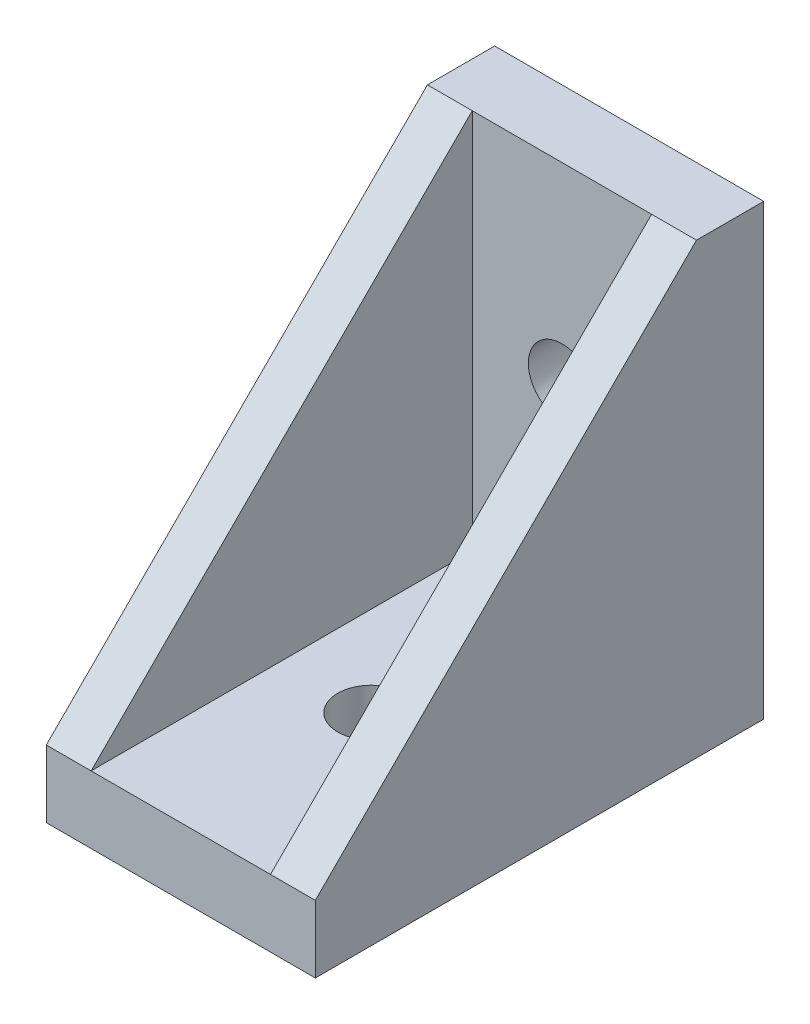
ISO-10303-21;
HEADER;
FILE_DESCRIPTION(('STEP AP214'),'2;1');
FILE_NAME('part.step','',(''),(''),'','','');
FILE_SCHEMA(('AUTOMOTIVE_DESIGN { 1 0 10303 214 1 1 1 1 }'));
ENDSEC;
DATA;
#1=APPLICATION_CONTEXT('core data for automotive mechanical design processes');
#2=APPLICATION_PROTOCOL_DEFINITION('international standard','automotive_design',2000,#1);
#3=PRODUCT_CONTEXT('',#1,'mechanical');
#4=PRODUCT('Part','Part','',(#3));
#5=PRODUCT_RELATED_PRODUCT_CATEGORY('part','',(#4));
#6=PRODUCT_DEFINITION_FORMATION('','',#4);
#7=PRODUCT_DEFINITION_CONTEXT('part definition',#1,'design');
#8=PRODUCT_DEFINITION('design','',#6,#7);
#9=PRODUCT_DEFINITION_SHAPE('','',#8);
#10=(LENGTH_UNIT() NAMED_UNIT(*) SI_UNIT(.MILLI.,.METRE.));
#11=(NAMED_UNIT(*) PLANE_ANGLE_UNIT() SI_UNIT($,.RADIAN.));
#12=(NAMED_UNIT(*) SI_UNIT($,.STERADIAN.) SOLID_ANGLE_UNIT());
#13=UNCERTAINTY_MEASURE_WITH_UNIT(LENGTH_MEASURE(1.E-05),#10,'distance_accuracy_value','');
#14=(GEOMETRIC_REPRESENTATION_CONTEXT(3) GLOBAL_UNCERTAINTY_ASSIGNED_CONTEXT((#13)) GLOBAL_UNIT_ASSIGNED_CONTEXT((#10,
#11,#12)) REPRESENTATION_CONTEXT('',''));
#15=CARTESIAN_POINT('',(0.,0.,0.));
#16=DIRECTION('',(0.,0.,1.));
#17=DIRECTION('',(1.,0.,0.));
#18=AXIS2_PLACEMENT_3D('',#15,#16,#17);
#19=CARTESIAN_POINT('',(6.,3.,0.));
#20=DIRECTION('',(0.,1.,0.));
#21=DIRECTION('',(0.,0.,1.));
#22=AXIS2_PLACEMENT_3D('',#19,#20,#21);
#23=PLANE('',#22);
#24=DIRECTION('',(0.,0.,-1.));
#25=VECTOR('',#24,1.);
#26=CARTESIAN_POINT('',(-4.,3.,0.));
#27=LINE('',#26,#25);
#28=CARTESIAN_POINT('',(-4.,3.,20.));
#29=VERTEX_POINT('',#28);
#30=CARTESIAN_POINT('',(-4.,3.,3.));
#31=VERTEX_POINT('',#30);
#32=EDGE_CURVE('E109',#29,#31,#27,.T.);
#33=ORIENTED_EDGE('',*,*,#32,.F.);
#34=DIRECTION('',(-1.,0.,0.));
#35=VECTOR('',#34,1.);
#36=CARTESIAN_POINT('',(6.,3.,20.));
#37=LINE('',#36,#35);
#38=CARTESIAN_POINT('',(4.,3.,20.));
#39=VERTEX_POINT('',#38);
#40=EDGE_CURVE('E131',#39,#29,#37,.T.);
#41=ORIENTED_EDGE('',*,*,#40,.F.);
#42=DIRECTION('',(0.,0.,-1.));
#43=VECTOR('',#42,1.);
#44=CARTESIAN_POINT('',(4.,3.,0.));
#45=LINE('',#44,#43);
#46=CARTESIAN_POINT('',(4.,3.,3.));
#47=VERTEX_POINT('',#46);
#48=EDGE_CURVE('E56',#39,#47,#45,.T.);
#49=ORIENTED_EDGE('',*,*,#48,.T.);
#50=DIRECTION('',(-1.,0.,0.));
#51=VECTOR('',#50,1.);
#52=CARTESIAN_POINT('',(6.,3.,3.));
#53=LINE('',#52,#51);
#54=EDGE_CURVE('E125',#47,#31,#53,.T.);
#55=ORIENTED_EDGE('',*,*,#54,.T.);
#56=EDGE_LOOP('',(#33,#41,#49,#55));
#57=FACE_BOUND('',#56,.T.);
#58=CARTESIAN_POINT('',(0.,2.99999999999998,11.5));
#59=DIRECTION('',(0.,-1.,0.));
#60=DIRECTION('',(1.,0.,0.));
#61=AXIS2_PLACEMENT_3D('',#58,#59,#60);
#62=CIRCLE('',#61,1.5);
#63=CARTESIAN_POINT('',(1.5,2.99999999999998,11.5));
#64=VERTEX_POINT('',#63);
#65=EDGE_CURVE('E174',#64,#64,#62,.T.);
#66=ORIENTED_EDGE('',*,*,#65,.T.);
#67=EDGE_LOOP('',(#66));
#68=FACE_BOUND('',#67,.T.);
#69=ADVANCED_FACE('F33',(#57,#68),#23,.T.);
#70=CARTESIAN_POINT('',(6.,0.,0.));
#71=DIRECTION('',(0.,-1.,0.));
#72=DIRECTION('',(0.,0.,-1.));
#73=AXIS2_PLACEMENT_3D('',#70,#71,#72);
#74=PLANE('',#73);
#75=DIRECTION('',(0.,0.,1.));
#76=VECTOR('',#75,1.);
#77=CARTESIAN_POINT('',(-6.,0.,0.));
#78=LINE('',#77,#76);
#79=CARTESIAN_POINT('',(-6.,0.,0.));
#80=VERTEX_POINT('',#79);
#81=CARTESIAN_POINT('',(-6.,0.,20.));
#82=VERTEX_POINT('',#81);
#83=EDGE_CURVE('E137',#80,#82,#78,.T.);
#84=ORIENTED_EDGE('',*,*,#83,.F.);
#85=DIRECTION('',(-1.,0.,0.));
#86=VECTOR('',#85,1.);
#87=CARTESIAN_POINT('',(6.,0.,0.));
#88=LINE('',#87,#86);
#89=CARTESIAN_POINT('',(6.,0.,0.));
#90=VERTEX_POINT('',#89);
#91=EDGE_CURVE('E134',#90,#80,#88,.T.);
#92=ORIENTED_EDGE('',*,*,#91,.F.);
#93=DIRECTION('',(0.,0.,1.));
#94=VECTOR('',#93,1.);
#95=CARTESIAN_POINT('',(6.,0.,0.));
#96=LINE('',#95,#94);
#97=CARTESIAN_POINT('',(6.,0.,20.));
#98=VERTEX_POINT('',#97);
#99=EDGE_CURVE('E136',#90,#98,#96,.T.);
#100=ORIENTED_EDGE('',*,*,#99,.T.);
#101=DIRECTION('',(-1.,0.,0.));
#102=VECTOR('',#101,1.);
#103=CARTESIAN_POINT('',(6.,0.,20.));
#104=LINE('',#103,#102);
#105=EDGE_CURVE('E132',#98,#82,#104,.T.);
#106=ORIENTED_EDGE('',*,*,#105,.T.);
#107=EDGE_LOOP('',(#84,#92,#100,#106));
#108=FACE_BOUND('',#107,.T.);
#109=CARTESIAN_POINT('',(0.,0.,11.5));
#110=DIRECTION('',(0.,-1.,0.));
#111=DIRECTION('',(1.,0.,0.));
#112=AXIS2_PLACEMENT_3D('',#109,#110,#111);
#113=CIRCLE('',#112,1.5);
#114=CARTESIAN_POINT('',(1.5,0.,11.5));
#115=VERTEX_POINT('',#114);
#116=EDGE_CURVE('E171',#115,#115,#113,.T.);
#117=ORIENTED_EDGE('',*,*,#116,.F.);
#118=EDGE_LOOP('',(#117));
#119=FACE_BOUND('',#118,.T.);
#120=ADVANCED_FACE('F183',(#108,#119),#74,.T.);
#121=CARTESIAN_POINT('',(6.,0.,3.));
#122=DIRECTION('',(0.,0.,1.));
#123=DIRECTION('',(1.,0.,0.));
#124=AXIS2_PLACEMENT_3D('',#121,#122,#123);
#125=PLANE('',#124);
#126=CARTESIAN_POINT('',(0.,11.5,3.));
#127=DIRECTION('',(0.,0.,1.));
#128=DIRECTION('',(1.,0.,0.));
#129=AXIS2_PLACEMENT_3D('',#126,#127,#128);
#130=CIRCLE('',#129,1.5);
#131=CARTESIAN_POINT('',(1.5,11.5,3.));
#132=VERTEX_POINT('',#131);
#133=EDGE_CURVE('E168',#132,#132,#130,.T.);
#134=ORIENTED_EDGE('',*,*,#133,.F.);
#135=EDGE_LOOP('',(#134));
#136=FACE_BOUND('',#135,.T.);
#137=DIRECTION('',(0.,1.,0.));
#138=VECTOR('',#137,1.);
#139=CARTESIAN_POINT('',(-4.,0.,3.));
#140=LINE('',#139,#138);
#141=CARTESIAN_POINT('',(-4.,20.,3.));
#142=VERTEX_POINT('',#141);
#143=EDGE_CURVE('E110',#31,#142,#140,.T.);
#144=ORIENTED_EDGE('',*,*,#143,.F.);
#145=ORIENTED_EDGE('',*,*,#54,.F.);
#146=DIRECTION('',(0.,1.,0.));
#147=VECTOR('',#146,1.);
#148=CARTESIAN_POINT('',(4.,0.,3.));
#149=LINE('',#148,#147);
#150=CARTESIAN_POINT('',(4.,20.,3.));
#151=VERTEX_POINT('',#150);
#152=EDGE_CURVE('E48',#47,#151,#149,.T.);
#153=ORIENTED_EDGE('',*,*,#152,.T.);
#154=DIRECTION('',(-1.,0.,0.));
#155=VECTOR('',#154,1.);
#156=CARTESIAN_POINT('',(6.,20.,3.));
#157=LINE('',#156,#155);
#158=EDGE_CURVE('E118',#151,#142,#157,.T.);
#159=ORIENTED_EDGE('',*,*,#158,.T.);
#160=EDGE_LOOP('',(#144,#145,#153,#159));
#161=FACE_BOUND('',#160,.T.);
#162=ADVANCED_FACE('F124',(#136,#161),#125,.T.);
#163=CARTESIAN_POINT('',(6.,0.,0.));
#164=DIRECTION('',(0.,0.,-1.));
#165=DIRECTION('',(0.,1.,0.));
#166=AXIS2_PLACEMENT_3D('',#163,#164,#165);
#167=PLANE('',#166);
#168=CARTESIAN_POINT('',(0.,11.5,0.));
#169=DIRECTION('',(0.,0.,1.));
#170=DIRECTION('',(1.,0.,0.));
#171=AXIS2_PLACEMENT_3D('',#168,#169,#170);
#172=CIRCLE('',#171,1.5);
#173=CARTESIAN_POINT('',(1.5,11.5,0.));
#174=VERTEX_POINT('',#173);
#175=EDGE_CURVE('E166',#174,#174,#172,.T.);
#176=ORIENTED_EDGE('',*,*,#175,.T.);
#177=EDGE_LOOP('',(#176));
#178=FACE_BOUND('',#177,.T.);
#179=DIRECTION('',(0.,-1.,0.));
#180=VECTOR('',#179,1.);
#181=CARTESIAN_POINT('',(-6.,0.,0.));
#182=LINE('',#181,#180);
#183=CARTESIAN_POINT('',(-6.,20.,0.));
#184=VERTEX_POINT('',#183);
#185=EDGE_CURVE('E145',#184,#80,#182,.T.);
#186=ORIENTED_EDGE('',*,*,#185,.F.);
#187=DIRECTION('',(-1.,0.,0.));
#188=VECTOR('',#187,1.);
#189=CARTESIAN_POINT('',(6.,20.,0.));
#190=LINE('',#189,#188);
#191=CARTESIAN_POINT('',(6.,20.,0.));
#192=VERTEX_POINT('',#191);
#193=EDGE_CURVE('E11',#192,#184,#190,.T.);
#194=ORIENTED_EDGE('',*,*,#193,.F.);
#195=DIRECTION('',(0.,-1.,0.));
#196=VECTOR('',#195,1.);
#197=CARTESIAN_POINT('',(6.,0.,0.));
#198=LINE('',#197,#196);
#199=EDGE_CURVE('E140',#192,#90,#198,.T.);
#200=ORIENTED_EDGE('',*,*,#199,.T.);
#201=ORIENTED_EDGE('',*,*,#91,.T.);
#202=EDGE_LOOP('',(#186,#194,#200,#201));
#203=FACE_BOUND('',#202,.T.);
#204=ADVANCED_FACE('F35',(#178,#203),#167,.T.);
#205=CARTESIAN_POINT('',(6.,20.,0.));
#206=DIRECTION('',(0.,1.,0.));
#207=DIRECTION('',(0.,0.,1.));
#208=AXIS2_PLACEMENT_3D('',#205,#206,#207);
#209=PLANE('',#208);
#210=DIRECTION('',(0.,0.,-1.));
#211=VECTOR('',#210,1.);
#212=CARTESIAN_POINT('',(-6.,20.,0.));
#213=LINE('',#212,#211);
#214=CARTESIAN_POINT('',(-6.,20.,3.));
#215=VERTEX_POINT('',#214);
#216=EDGE_CURVE('E121',#215,#184,#213,.T.);
#217=ORIENTED_EDGE('',*,*,#216,.F.);
#218=DIRECTION('',(-1.,0.,0.));
#219=VECTOR('',#218,1.);
#220=CARTESIAN_POINT('',(-4.,20.,3.));
#221=LINE('',#220,#219);
#222=EDGE_CURVE('E103',#142,#215,#221,.T.);
#223=ORIENTED_EDGE('',*,*,#222,.F.);
#224=ORIENTED_EDGE('',*,*,#158,.F.);
#225=CARTESIAN_POINT('',(6.,20.,3.));
#226=VERTEX_POINT('',#225);
#227=EDGE_CURVE('E41',#226,#151,#157,.T.);
#228=ORIENTED_EDGE('',*,*,#227,.F.);
#229=DIRECTION('',(0.,0.,-1.));
#230=VECTOR('',#229,1.);
#231=CARTESIAN_POINT('',(6.,20.,0.));
#232=LINE('',#231,#230);
#233=EDGE_CURVE('E152',#226,#192,#232,.T.);
#234=ORIENTED_EDGE('',*,*,#233,.T.);
#235=ORIENTED_EDGE('',*,*,#193,.T.);
#236=EDGE_LOOP('',(#217,#223,#224,#228,#234,#235));
#237=FACE_BOUND('',#236,.T.);
#238=ADVANCED_FACE('F117',(#237),#209,.T.);
#239=CARTESIAN_POINT('',(6.,0.,20.));
#240=DIRECTION('',(0.,0.,1.));
#241=DIRECTION('',(1.,0.,0.));
#242=AXIS2_PLACEMENT_3D('',#239,#240,#241);
#243=PLANE('',#242);
#244=DIRECTION('',(0.,1.,0.));
#245=VECTOR('',#244,1.);
#246=CARTESIAN_POINT('',(-6.,0.,20.));
#247=LINE('',#246,#245);
#248=CARTESIAN_POINT('',(-6.,3.,20.));
#249=VERTEX_POINT('',#248);
#250=EDGE_CURVE('E141',#82,#249,#247,.T.);
#251=ORIENTED_EDGE('',*,*,#250,.F.);
#252=ORIENTED_EDGE('',*,*,#105,.F.);
#253=DIRECTION('',(0.,1.,0.));
#254=VECTOR('',#253,1.);
#255=CARTESIAN_POINT('',(6.,0.,20.));
#256=LINE('',#255,#254);
#257=CARTESIAN_POINT('',(6.,3.,20.));
#258=VERTEX_POINT('',#257);
#259=EDGE_CURVE('E150',#98,#258,#256,.T.);
#260=ORIENTED_EDGE('',*,*,#259,.T.);
#261=EDGE_CURVE('E126',#258,#39,#37,.T.);
#262=ORIENTED_EDGE('',*,*,#261,.T.);
#263=ORIENTED_EDGE('',*,*,#40,.T.);
#264=DIRECTION('',(-1.,0.,0.));
#265=VECTOR('',#264,1.);
#266=CARTESIAN_POINT('',(-4.,3.,20.));
#267=LINE('',#266,#265);
#268=EDGE_CURVE('E106',#29,#249,#267,.T.);
#269=ORIENTED_EDGE('',*,*,#268,.T.);
#270=EDGE_LOOP('',(#251,#252,#260,#262,#263,#269));
#271=FACE_BOUND('',#270,.T.);
#272=ADVANCED_FACE('F199',(#271),#243,.T.);
#273=CARTESIAN_POINT('',(6.,0.,0.));
#274=DIRECTION('',(1.,0.,0.));
#275=DIRECTION('',(0.,0.,-1.));
#276=AXIS2_PLACEMENT_3D('',#273,#274,#275);
#277=PLANE('',#276);
#278=ORIENTED_EDGE('',*,*,#233,.F.);
#279=DIRECTION('',(0.,-0.707106781186548,0.707106781186548));
#280=VECTOR('',#279,1.);
#281=CARTESIAN_POINT('',(6.,11.5,11.5));
#282=LINE('',#281,#280);
#283=EDGE_CURVE('E122',#226,#258,#282,.T.);
#284=ORIENTED_EDGE('',*,*,#283,.T.);
#285=ORIENTED_EDGE('',*,*,#259,.F.);
#286=ORIENTED_EDGE('',*,*,#99,.F.);
#287=ORIENTED_EDGE('',*,*,#199,.F.);
#288=EDGE_LOOP('',(#278,#284,#285,#286,#287));
#289=FACE_BOUND('',#288,.T.);
#290=ADVANCED_FACE('F201',(#289),#277,.T.);
#291=CARTESIAN_POINT('',(-6.,0.,0.));
#292=DIRECTION('',(1.,0.,0.));
#293=DIRECTION('',(0.,0.,-1.));
#294=AXIS2_PLACEMENT_3D('',#291,#292,#293);
#295=PLANE('',#294);
#296=DIRECTION('',(0.,-0.707106781186548,0.707106781186548));
#297=VECTOR('',#296,1.);
#298=CARTESIAN_POINT('',(-6.,11.5,11.5));
#299=LINE('',#298,#297);
#300=EDGE_CURVE('E114',#215,#249,#299,.T.);
#301=ORIENTED_EDGE('',*,*,#300,.F.);
#302=ORIENTED_EDGE('',*,*,#216,.T.);
#303=ORIENTED_EDGE('',*,*,#185,.T.);
#304=ORIENTED_EDGE('',*,*,#83,.T.);
#305=ORIENTED_EDGE('',*,*,#250,.T.);
#306=EDGE_LOOP('',(#301,#302,#303,#304,#305));
#307=FACE_BOUND('',#306,.T.);
#308=ADVANCED_FACE('F197',(#307),#295,.F.);
#309=CARTESIAN_POINT('',(4.,11.5,11.5));
#310=DIRECTION('',(0.,0.707106781186547,0.707106781186547));
#311=DIRECTION('',(0.,-0.707106781186548,0.707106781186548));
#312=AXIS2_PLACEMENT_3D('',#309,#310,#311);
#313=PLANE('',#312);
#314=ORIENTED_EDGE('',*,*,#283,.F.);
#315=ORIENTED_EDGE('',*,*,#227,.T.);
#316=DIRECTION('',(0.,-0.707106781186548,0.707106781186548));
#317=VECTOR('',#316,1.);
#318=CARTESIAN_POINT('',(4.,11.5,11.5));
#319=LINE('',#318,#317);
#320=EDGE_CURVE('E160',#151,#39,#319,.T.);
#321=ORIENTED_EDGE('',*,*,#320,.T.);
#322=ORIENTED_EDGE('',*,*,#261,.F.);
#323=EDGE_LOOP('',(#314,#315,#321,#322));
#324=FACE_BOUND('',#323,.T.);
#325=ADVANCED_FACE('F224',(#324),#313,.T.);
#326=CARTESIAN_POINT('',(4.,0.,0.));
#327=DIRECTION('',(1.,0.,0.));
#328=DIRECTION('',(0.,0.,-1.));
#329=AXIS2_PLACEMENT_3D('',#326,#327,#328);
#330=PLANE('',#329);
#331=ORIENTED_EDGE('',*,*,#152,.F.);
#332=ORIENTED_EDGE('',*,*,#48,.F.);
#333=ORIENTED_EDGE('',*,*,#320,.F.);
#334=EDGE_LOOP('',(#331,#332,#333));
#335=FACE_BOUND('',#334,.T.);
#336=ADVANCED_FACE('F221',(#335),#330,.F.);
#337=CARTESIAN_POINT('',(-4.,11.5,11.5));
#338=DIRECTION('',(0.,-0.707106781186547,-0.707106781186547));
#339=DIRECTION('',(0.,0.707106781186548,-0.707106781186548));
#340=AXIS2_PLACEMENT_3D('',#337,#338,#339);
#341=PLANE('',#340);
#342=ORIENTED_EDGE('',*,*,#300,.T.);
#343=ORIENTED_EDGE('',*,*,#268,.F.);
#344=DIRECTION('',(0.,-0.707106781186548,0.707106781186548));
#345=VECTOR('',#344,1.);
#346=CARTESIAN_POINT('',(-4.,11.5,11.5));
#347=LINE('',#346,#345);
#348=EDGE_CURVE('E99',#142,#29,#347,.T.);
#349=ORIENTED_EDGE('',*,*,#348,.F.);
#350=ORIENTED_EDGE('',*,*,#222,.T.);
#351=EDGE_LOOP('',(#342,#343,#349,#350));
#352=FACE_BOUND('',#351,.T.);
#353=ADVANCED_FACE('F101',(#352),#341,.F.);
#354=CARTESIAN_POINT('',(-4.,0.,0.));
#355=DIRECTION('',(1.,0.,0.));
#356=DIRECTION('',(0.,0.,-1.));
#357=AXIS2_PLACEMENT_3D('',#354,#355,#356);
#358=PLANE('',#357);
#359=ORIENTED_EDGE('',*,*,#143,.T.);
#360=ORIENTED_EDGE('',*,*,#348,.T.);
#361=ORIENTED_EDGE('',*,*,#32,.T.);
#362=EDGE_LOOP('',(#359,#360,#361));
#363=FACE_BOUND('',#362,.T.);
#364=ADVANCED_FACE('F113',(#363),#358,.T.);
#365=CARTESIAN_POINT('',(0.,11.5,0.));
#366=DIRECTION('',(0.,0.,1.));
#367=DIRECTION('',(1.,0.,0.));
#368=AXIS2_PLACEMENT_3D('',#365,#366,#367);
#369=CYLINDRICAL_SURFACE('',#368,1.5);
#370=ORIENTED_EDGE('',*,*,#175,.F.);
#371=EDGE_LOOP('',(#370));
#372=FACE_BOUND('',#371,.T.);
#373=ORIENTED_EDGE('',*,*,#133,.T.);
#374=EDGE_LOOP('',(#373));
#375=FACE_BOUND('',#374,.T.);
#376=ADVANCED_FACE('F242',(#372,#375),#369,.F.);
#377=CARTESIAN_POINT('',(0.,0.,11.5));
#378=DIRECTION('',(0.,1.,0.));
#379=DIRECTION('',(0.,0.,1.));
#380=AXIS2_PLACEMENT_3D('',#377,#378,#379);
#381=CYLINDRICAL_SURFACE('',#380,1.5);
#382=ORIENTED_EDGE('',*,*,#116,.T.);
#383=EDGE_LOOP('',(#382));
#384=FACE_BOUND('',#383,.T.);
#385=ORIENTED_EDGE('',*,*,#65,.F.);
#386=EDGE_LOOP('',(#385));
#387=FACE_BOUND('',#386,.T.);
#388=ADVANCED_FACE('F180',(#384,#387),#381,.F.);
#389=CLOSED_SHELL('',(#69,#120,#162,#204,#238,#272,#290,#308,#325,#336,#353,#364,#376,#388));
#390=MANIFOLD_SOLID_BREP('B2',#389);
#391=ADVANCED_BREP_SHAPE_REPRESENTATION('',(#18,#390),#14);
#392=SHAPE_DEFINITION_REPRESENTATION(#9,#391);
ENDSEC;
END-ISO-10303-21;
